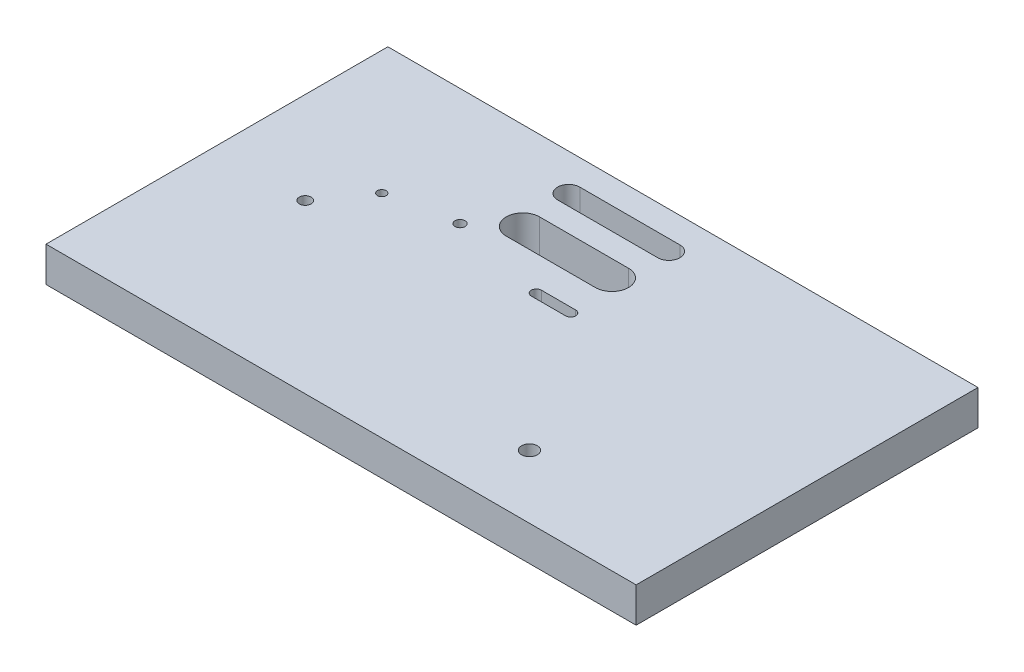
ISO-10303-21;
HEADER;
FILE_DESCRIPTION(('STEP AP214'),'2;1');
FILE_NAME('part.step','',(''),(''),'','','');
FILE_SCHEMA(('AUTOMOTIVE_DESIGN { 1 0 10303 214 1 1 1 1 }'));
ENDSEC;
DATA;
#1=APPLICATION_CONTEXT('core data for automotive mechanical design processes');
#2=APPLICATION_PROTOCOL_DEFINITION('international standard','automotive_design',2000,#1);
#3=PRODUCT_CONTEXT('',#1,'mechanical');
#4=PRODUCT('Part','Part','',(#3));
#5=PRODUCT_RELATED_PRODUCT_CATEGORY('part','',(#4));
#6=PRODUCT_DEFINITION_FORMATION('','',#4);
#7=PRODUCT_DEFINITION_CONTEXT('part definition',#1,'design');
#8=PRODUCT_DEFINITION('design','',#6,#7);
#9=PRODUCT_DEFINITION_SHAPE('','',#8);
#10=(LENGTH_UNIT() NAMED_UNIT(*) SI_UNIT(.MILLI.,.METRE.));
#11=(NAMED_UNIT(*) PLANE_ANGLE_UNIT() SI_UNIT($,.RADIAN.));
#12=(NAMED_UNIT(*) SI_UNIT($,.STERADIAN.) SOLID_ANGLE_UNIT());
#13=UNCERTAINTY_MEASURE_WITH_UNIT(LENGTH_MEASURE(1.E-05),#10,'distance_accuracy_value','');
#14=(GEOMETRIC_REPRESENTATION_CONTEXT(3) GLOBAL_UNCERTAINTY_ASSIGNED_CONTEXT((#13)) GLOBAL_UNIT_ASSIGNED_CONTEXT((#10,
#11,#12)) REPRESENTATION_CONTEXT('',''));
#15=CARTESIAN_POINT('',(0.,0.,0.));
#16=DIRECTION('',(0.,0.,1.));
#17=DIRECTION('',(1.,0.,0.));
#18=AXIS2_PLACEMENT_3D('',#15,#16,#17);
#19=CARTESIAN_POINT('',(0.,5.,0.));
#20=DIRECTION('',(0.,1.,0.));
#21=DIRECTION('',(0.,0.,1.));
#22=AXIS2_PLACEMENT_3D('',#19,#20,#21);
#23=PLANE('',#22);
#24=DIRECTION('',(0.,0.,-1.));
#25=VECTOR('',#24,1.);
#26=CARTESIAN_POINT('',(84.3608093431512,5.,0.));
#27=LINE('',#26,#25);
#28=CARTESIAN_POINT('',(84.3608093431512,5.,0.));
#29=VERTEX_POINT('',#28);
#30=CARTESIAN_POINT('',(84.3608093431512,5.,-97.739616111228));
#31=VERTEX_POINT('',#30);
#32=EDGE_CURVE('E493',#29,#31,#27,.T.);
#33=ORIENTED_EDGE('',*,*,#32,.T.);
#34=DIRECTION('',(-1.,0.,0.));
#35=VECTOR('',#34,1.);
#36=CARTESIAN_POINT('',(84.3608093431512,5.,-97.739616111228));
#37=LINE('',#36,#35);
#38=CARTESIAN_POINT('',(-84.3608093431512,5.,-97.739616111228));
#39=VERTEX_POINT('',#38);
#40=EDGE_CURVE('E496',#31,#39,#37,.T.);
#41=ORIENTED_EDGE('',*,*,#40,.T.);
#42=DIRECTION('',(0.,0.,1.));
#43=VECTOR('',#42,1.);
#44=CARTESIAN_POINT('',(-84.3608093431512,5.,0.));
#45=LINE('',#44,#43);
#46=CARTESIAN_POINT('',(-84.3608093431512,5.,0.));
#47=VERTEX_POINT('',#46);
#48=EDGE_CURVE('E499',#39,#47,#45,.T.);
#49=ORIENTED_EDGE('',*,*,#48,.T.);
#50=DIRECTION('',(1.,0.,0.));
#51=VECTOR('',#50,1.);
#52=CARTESIAN_POINT('',(84.3608093431512,5.,0.));
#53=LINE('',#52,#51);
#54=EDGE_CURVE('E501',#47,#29,#53,.T.);
#55=ORIENTED_EDGE('',*,*,#54,.T.);
#56=EDGE_LOOP('',(#33,#41,#49,#55));
#57=FACE_BOUND('',#56,.T.);
#58=CARTESIAN_POINT('',(-58.1138542371732,5.,-47.8549594350749));
#59=DIRECTION('',(0.,1.,0.));
#60=DIRECTION('',(0.,0.,1.));
#61=AXIS2_PLACEMENT_3D('',#58,#59,#60);
#62=CIRCLE('',#61,1.7);
#63=CARTESIAN_POINT('',(-58.1138542371732,5.,-46.1549594350749));
#64=VERTEX_POINT('',#63);
#65=EDGE_CURVE('E486',#64,#64,#62,.T.);
#66=ORIENTED_EDGE('',*,*,#65,.F.);
#67=EDGE_LOOP('',(#66));
#68=FACE_BOUND('',#67,.T.);
#69=CARTESIAN_POINT('',(-48.9861644972557,5.,-60.622514535719));
#70=DIRECTION('',(0.,1.,0.));
#71=DIRECTION('',(0.,0.,1.));
#72=AXIS2_PLACEMENT_3D('',#69,#70,#71);
#73=CIRCLE('',#72,1.25);
#74=CARTESIAN_POINT('',(-48.9861644972557,5.,-59.372514535719));
#75=VERTEX_POINT('',#74);
#76=EDGE_CURVE('E480',#75,#75,#73,.T.);
#77=ORIENTED_EDGE('',*,*,#76,.F.);
#78=EDGE_LOOP('',(#77));
#79=FACE_BOUND('',#78,.T.);
#80=CARTESIAN_POINT('',(-30.247448848378,5.,-64.270030424007));
#81=DIRECTION('',(0.,1.,0.));
#82=DIRECTION('',(0.,0.,1.));
#83=AXIS2_PLACEMENT_3D('',#80,#81,#82);
#84=CIRCLE('',#83,1.45);
#85=CARTESIAN_POINT('',(-30.247448848378,5.,-62.8200304240071));
#86=VERTEX_POINT('',#85);
#87=EDGE_CURVE('E474',#86,#86,#84,.T.);
#88=ORIENTED_EDGE('',*,*,#87,.F.);
#89=EDGE_LOOP('',(#88));
#90=FACE_BOUND('',#89,.T.);
#91=CARTESIAN_POINT('',(35.7902377850241,5.,-18.0705278971374));
#92=DIRECTION('',(0.,1.,0.));
#93=DIRECTION('',(0.,0.,1.));
#94=AXIS2_PLACEMENT_3D('',#91,#92,#93);
#95=CIRCLE('',#94,2.25);
#96=CARTESIAN_POINT('',(35.7902377850241,5.,-15.8205278971374));
#97=VERTEX_POINT('',#96);
#98=EDGE_CURVE('E468',#97,#97,#95,.T.);
#99=ORIENTED_EDGE('',*,*,#98,.F.);
#100=EDGE_LOOP('',(#99));
#101=FACE_BOUND('',#100,.T.);
#102=CARTESIAN_POINT('',(-2.13594485593026,5.,-57.9697826681667));
#103=DIRECTION('',(0.,1.,0.));
#104=DIRECTION('',(0.,0.,1.));
#105=AXIS2_PLACEMENT_3D('',#102,#103,#104);
#106=CIRCLE('',#105,1.45);
#107=CARTESIAN_POINT('',(-2.13594485593026,5.,-59.4197826681667));
#108=VERTEX_POINT('',#107);
#109=CARTESIAN_POINT('',(-2.13594485593026,5.,-56.5197826681667));
#110=VERTEX_POINT('',#109);
#111=EDGE_CURVE('E447',#108,#110,#106,.T.);
#112=ORIENTED_EDGE('',*,*,#111,.F.);
#113=DIRECTION('',(1.,0.,0.));
#114=VECTOR('',#113,1.);
#115=CARTESIAN_POINT('',(-2.13594485593026,5.,-59.4197826681667));
#116=LINE('',#115,#114);
#117=CARTESIAN_POINT('',(7.66405514406974,5.,-59.4197826681667));
#118=VERTEX_POINT('',#117);
#119=EDGE_CURVE('E444',#108,#118,#116,.T.);
#120=ORIENTED_EDGE('',*,*,#119,.T.);
#121=CARTESIAN_POINT('',(7.66405514406974,5.,-57.9697826681667));
#122=DIRECTION('',(0.,1.,0.));
#123=DIRECTION('',(0.,0.,1.));
#124=AXIS2_PLACEMENT_3D('',#121,#122,#123);
#125=CIRCLE('',#124,1.45);
#126=CARTESIAN_POINT('',(7.66405514406974,5.,-56.5197826681667));
#127=VERTEX_POINT('',#126);
#128=EDGE_CURVE('E457',#127,#118,#125,.T.);
#129=ORIENTED_EDGE('',*,*,#128,.F.);
#130=DIRECTION('',(1.,0.,0.));
#131=VECTOR('',#130,1.);
#132=CARTESIAN_POINT('',(-2.13594485593026,5.,-56.5197826681666));
#133=LINE('',#132,#131);
#134=EDGE_CURVE('E436',#110,#127,#133,.T.);
#135=ORIENTED_EDGE('',*,*,#134,.F.);
#136=EDGE_LOOP('',(#112,#120,#129,#135));
#137=FACE_BOUND('',#136,.T.);
#138=DIRECTION('',(1.,0.,0.));
#139=VECTOR('',#138,1.);
#140=CARTESIAN_POINT('',(-20.5727153209111,5.,-77.3083922894191));
#141=LINE('',#140,#139);
#142=CARTESIAN_POINT('',(-20.5727153209111,5.,-77.3083922894191));
#143=VERTEX_POINT('',#142);
#144=CARTESIAN_POINT('',(4.90229087908889,5.,-77.3083922894191));
#145=VERTEX_POINT('',#144);
#146=EDGE_CURVE('E413',#143,#145,#141,.T.);
#147=ORIENTED_EDGE('',*,*,#146,.T.);
#148=CARTESIAN_POINT('',(4.90229087908889,5.,-72.5458922894191));
#149=DIRECTION('',(0.,1.,0.));
#150=DIRECTION('',(0.,0.,1.));
#151=AXIS2_PLACEMENT_3D('',#148,#149,#150);
#152=CIRCLE('',#151,4.7625);
#153=CARTESIAN_POINT('',(4.90229087908889,5.,-67.7833922894191));
#154=VERTEX_POINT('',#153);
#155=EDGE_CURVE('E426',#154,#145,#152,.T.);
#156=ORIENTED_EDGE('',*,*,#155,.F.);
#157=DIRECTION('',(1.,0.,0.));
#158=VECTOR('',#157,1.);
#159=CARTESIAN_POINT('',(-20.5727153209111,5.,-67.7833922894191));
#160=LINE('',#159,#158);
#161=CARTESIAN_POINT('',(-20.5727153209111,5.,-67.7833922894191));
#162=VERTEX_POINT('',#161);
#163=EDGE_CURVE('E406',#162,#154,#160,.T.);
#164=ORIENTED_EDGE('',*,*,#163,.F.);
#165=CARTESIAN_POINT('',(-20.5727153209111,5.,-72.5458922894191));
#166=DIRECTION('',(0.,1.,0.));
#167=DIRECTION('',(0.,0.,1.));
#168=AXIS2_PLACEMENT_3D('',#165,#166,#167);
#169=CIRCLE('',#168,4.7625);
#170=EDGE_CURVE('E416',#143,#162,#169,.T.);
#171=ORIENTED_EDGE('',*,*,#170,.F.);
#172=EDGE_LOOP('',(#147,#156,#164,#171));
#173=FACE_BOUND('',#172,.T.);
#174=CARTESIAN_POINT('',(-22.1870017630031,5.,-87.2550365653098));
#175=DIRECTION('',(0.,1.,0.));
#176=DIRECTION('',(0.,0.,1.));
#177=AXIS2_PLACEMENT_3D('',#174,#175,#176);
#178=CIRCLE('',#177,3.175);
#179=CARTESIAN_POINT('',(-22.1870017630031,5.,-90.4300365653097));
#180=VERTEX_POINT('',#179);
#181=CARTESIAN_POINT('',(-22.1870017630031,5.,-84.0800365653098));
#182=VERTEX_POINT('',#181);
#183=EDGE_CURVE('E273',#180,#182,#178,.T.);
#184=ORIENTED_EDGE('',*,*,#183,.F.);
#185=DIRECTION('',(1.,0.,0.));
#186=VECTOR('',#185,1.);
#187=CARTESIAN_POINT('',(-22.1870017630031,5.,-90.4300365653097));
#188=LINE('',#187,#186);
#189=CARTESIAN_POINT('',(6.46300443699692,5.,-90.4300365653097));
#190=VERTEX_POINT('',#189);
#191=EDGE_CURVE('E375',#180,#190,#188,.T.);
#192=ORIENTED_EDGE('',*,*,#191,.T.);
#193=CARTESIAN_POINT('',(6.46300443699692,5.,-87.2550365653098));
#194=DIRECTION('',(0.,1.,0.));
#195=DIRECTION('',(0.,0.,1.));
#196=AXIS2_PLACEMENT_3D('',#193,#194,#195);
#197=CIRCLE('',#196,3.175);
#198=CARTESIAN_POINT('',(6.46300443699692,5.,-84.0800365653097));
#199=VERTEX_POINT('',#198);
#200=EDGE_CURVE('E390',#199,#190,#197,.T.);
#201=ORIENTED_EDGE('',*,*,#200,.F.);
#202=DIRECTION('',(1.,0.,0.));
#203=VECTOR('',#202,1.);
#204=CARTESIAN_POINT('',(-22.1870017630031,5.,-84.0800365653097));
#205=LINE('',#204,#203);
#206=EDGE_CURVE('E394',#182,#199,#205,.T.);
#207=ORIENTED_EDGE('',*,*,#206,.F.);
#208=EDGE_LOOP('',(#184,#192,#201,#207));
#209=FACE_BOUND('',#208,.T.);
#210=ADVANCED_FACE('F258',(#57,#68,#79,#90,#101,#137,#173,#209),#23,.T.);
#211=CARTESIAN_POINT('',(84.3608093431512,5.,0.));
#212=DIRECTION('',(-1.,0.,0.));
#213=DIRECTION('',(0.,0.,1.));
#214=AXIS2_PLACEMENT_3D('',#211,#212,#213);
#215=PLANE('',#214);
#216=DIRECTION('',(0.,0.,-1.));
#217=VECTOR('',#216,1.);
#218=CARTESIAN_POINT('',(84.3608093431512,-5.,0.));
#219=LINE('',#218,#217);
#220=CARTESIAN_POINT('',(84.3608093431512,-5.,0.));
#221=VERTEX_POINT('',#220);
#222=CARTESIAN_POINT('',(84.3608093431512,-5.,-97.739616111228));
#223=VERTEX_POINT('',#222);
#224=EDGE_CURVE('E492',#221,#223,#219,.T.);
#225=ORIENTED_EDGE('',*,*,#224,.T.);
#226=DIRECTION('',(0.,-1.,0.));
#227=VECTOR('',#226,1.);
#228=CARTESIAN_POINT('',(84.3608093431512,5.,-97.739616111228));
#229=LINE('',#228,#227);
#230=EDGE_CURVE('E13',#31,#223,#229,.T.);
#231=ORIENTED_EDGE('',*,*,#230,.F.);
#232=ORIENTED_EDGE('',*,*,#32,.F.);
#233=DIRECTION('',(0.,-1.,0.));
#234=VECTOR('',#233,1.);
#235=CARTESIAN_POINT('',(84.3608093431512,5.,0.));
#236=LINE('',#235,#234);
#237=EDGE_CURVE('E503',#29,#221,#236,.T.);
#238=ORIENTED_EDGE('',*,*,#237,.T.);
#239=EDGE_LOOP('',(#225,#231,#232,#238));
#240=FACE_BOUND('',#239,.T.);
#241=ADVANCED_FACE('F260',(#240),#215,.F.);
#242=CARTESIAN_POINT('',(84.3608093431512,5.,-97.739616111228));
#243=DIRECTION('',(0.,0.,1.));
#244=DIRECTION('',(1.,0.,0.));
#245=AXIS2_PLACEMENT_3D('',#242,#243,#244);
#246=PLANE('',#245);
#247=DIRECTION('',(-1.,0.,0.));
#248=VECTOR('',#247,1.);
#249=CARTESIAN_POINT('',(84.3608093431512,-5.,-97.739616111228));
#250=LINE('',#249,#248);
#251=CARTESIAN_POINT('',(-84.3608093431512,-5.,-97.739616111228));
#252=VERTEX_POINT('',#251);
#253=EDGE_CURVE('E506',#223,#252,#250,.T.);
#254=ORIENTED_EDGE('',*,*,#253,.T.);
#255=DIRECTION('',(0.,-1.,0.));
#256=VECTOR('',#255,1.);
#257=CARTESIAN_POINT('',(-84.3608093431512,5.,-97.739616111228));
#258=LINE('',#257,#256);
#259=EDGE_CURVE('E266',#39,#252,#258,.T.);
#260=ORIENTED_EDGE('',*,*,#259,.F.);
#261=ORIENTED_EDGE('',*,*,#40,.F.);
#262=ORIENTED_EDGE('',*,*,#230,.T.);
#263=EDGE_LOOP('',(#254,#260,#261,#262));
#264=FACE_BOUND('',#263,.T.);
#265=ADVANCED_FACE('F536',(#264),#246,.F.);
#266=CARTESIAN_POINT('',(-84.3608093431512,5.,0.));
#267=DIRECTION('',(1.,0.,0.));
#268=DIRECTION('',(0.,0.,-1.));
#269=AXIS2_PLACEMENT_3D('',#266,#267,#268);
#270=PLANE('',#269);
#271=DIRECTION('',(0.,0.,1.));
#272=VECTOR('',#271,1.);
#273=CARTESIAN_POINT('',(-84.3608093431512,-5.,0.));
#274=LINE('',#273,#272);
#275=CARTESIAN_POINT('',(-84.3608093431512,-5.,0.));
#276=VERTEX_POINT('',#275);
#277=EDGE_CURVE('E508',#252,#276,#274,.T.);
#278=ORIENTED_EDGE('',*,*,#277,.T.);
#279=DIRECTION('',(0.,-1.,0.));
#280=VECTOR('',#279,1.);
#281=CARTESIAN_POINT('',(-84.3608093431512,5.,0.));
#282=LINE('',#281,#280);
#283=EDGE_CURVE('E513',#47,#276,#282,.T.);
#284=ORIENTED_EDGE('',*,*,#283,.F.);
#285=ORIENTED_EDGE('',*,*,#48,.F.);
#286=ORIENTED_EDGE('',*,*,#259,.T.);
#287=EDGE_LOOP('',(#278,#284,#285,#286));
#288=FACE_BOUND('',#287,.T.);
#289=ADVANCED_FACE('F520',(#288),#270,.F.);
#290=CARTESIAN_POINT('',(84.3608093431512,5.,0.));
#291=DIRECTION('',(0.,0.,-1.));
#292=DIRECTION('',(-1.,0.,0.));
#293=AXIS2_PLACEMENT_3D('',#290,#291,#292);
#294=PLANE('',#293);
#295=DIRECTION('',(1.,0.,0.));
#296=VECTOR('',#295,1.);
#297=CARTESIAN_POINT('',(84.3608093431512,-5.,0.));
#298=LINE('',#297,#296);
#299=EDGE_CURVE('E497',#276,#221,#298,.T.);
#300=ORIENTED_EDGE('',*,*,#299,.T.);
#301=ORIENTED_EDGE('',*,*,#237,.F.);
#302=ORIENTED_EDGE('',*,*,#54,.F.);
#303=ORIENTED_EDGE('',*,*,#283,.T.);
#304=EDGE_LOOP('',(#300,#301,#302,#303));
#305=FACE_BOUND('',#304,.T.);
#306=ADVANCED_FACE('F529',(#305),#294,.F.);
#307=CARTESIAN_POINT('',(0.,-5.,0.));
#308=DIRECTION('',(0.,1.,0.));
#309=DIRECTION('',(0.,0.,1.));
#310=AXIS2_PLACEMENT_3D('',#307,#308,#309);
#311=PLANE('',#310);
#312=DIRECTION('',(1.,0.,0.));
#313=VECTOR('',#312,1.);
#314=CARTESIAN_POINT('',(-22.1870017630031,-5.,-84.0800365653098));
#315=LINE('',#314,#313);
#316=CARTESIAN_POINT('',(-22.1870017630031,-5.,-84.0800365653098));
#317=VERTEX_POINT('',#316);
#318=CARTESIAN_POINT('',(6.46300443699692,-5.,-84.0800365653098));
#319=VERTEX_POINT('',#318);
#320=EDGE_CURVE('E708',#317,#319,#315,.T.);
#321=ORIENTED_EDGE('',*,*,#320,.T.);
#322=CARTESIAN_POINT('',(6.46300443699692,-5.,-87.2550365653098));
#323=DIRECTION('',(0.,1.,0.));
#324=DIRECTION('',(0.,0.,1.));
#325=AXIS2_PLACEMENT_3D('',#322,#323,#324);
#326=CIRCLE('',#325,3.175);
#327=CARTESIAN_POINT('',(6.46300443699692,-5.,-90.4300365653097));
#328=VERTEX_POINT('',#327);
#329=EDGE_CURVE('E401',#319,#328,#326,.T.);
#330=ORIENTED_EDGE('',*,*,#329,.T.);
#331=DIRECTION('',(1.,0.,0.));
#332=VECTOR('',#331,1.);
#333=CARTESIAN_POINT('',(-22.1870017630031,-5.,-90.4300365653097));
#334=LINE('',#333,#332);
#335=CARTESIAN_POINT('',(-22.1870017630031,-5.,-90.4300365653097));
#336=VERTEX_POINT('',#335);
#337=EDGE_CURVE('E384',#336,#328,#334,.T.);
#338=ORIENTED_EDGE('',*,*,#337,.F.);
#339=CARTESIAN_POINT('',(-22.1870017630031,-5.,-87.2550365653098));
#340=DIRECTION('',(0.,1.,0.));
#341=DIRECTION('',(0.,0.,1.));
#342=AXIS2_PLACEMENT_3D('',#339,#340,#341);
#343=CIRCLE('',#342,3.175);
#344=EDGE_CURVE('E388',#336,#317,#343,.T.);
#345=ORIENTED_EDGE('',*,*,#344,.T.);
#346=EDGE_LOOP('',(#321,#330,#338,#345));
#347=FACE_BOUND('',#346,.T.);
#348=CARTESIAN_POINT('',(4.90229087908889,-5.,-72.5458922894191));
#349=DIRECTION('',(0.,1.,0.));
#350=DIRECTION('',(0.,0.,1.));
#351=AXIS2_PLACEMENT_3D('',#348,#349,#350);
#352=CIRCLE('',#351,4.7625);
#353=CARTESIAN_POINT('',(4.90229087908889,-5.,-67.7833922894191));
#354=VERTEX_POINT('',#353);
#355=CARTESIAN_POINT('',(4.90229087908889,-5.,-77.3083922894191));
#356=VERTEX_POINT('',#355);
#357=EDGE_CURVE('E429',#354,#356,#352,.T.);
#358=ORIENTED_EDGE('',*,*,#357,.T.);
#359=DIRECTION('',(1.,0.,0.));
#360=VECTOR('',#359,1.);
#361=CARTESIAN_POINT('',(-20.5727153209111,-5.,-77.3083922894191));
#362=LINE('',#361,#360);
#363=CARTESIAN_POINT('',(-20.5727153209111,-5.,-77.3083922894191));
#364=VERTEX_POINT('',#363);
#365=EDGE_CURVE('E411',#364,#356,#362,.T.);
#366=ORIENTED_EDGE('',*,*,#365,.F.);
#367=CARTESIAN_POINT('',(-20.5727153209111,-5.,-72.5458922894191));
#368=DIRECTION('',(0.,1.,0.));
#369=DIRECTION('',(0.,0.,1.));
#370=AXIS2_PLACEMENT_3D('',#367,#368,#369);
#371=CIRCLE('',#370,4.7625);
#372=CARTESIAN_POINT('',(-20.5727153209111,-4.99999999999999,-67.7833922894191));
#373=VERTEX_POINT('',#372);
#374=EDGE_CURVE('E418',#364,#373,#371,.T.);
#375=ORIENTED_EDGE('',*,*,#374,.T.);
#376=DIRECTION('',(1.,0.,0.));
#377=VECTOR('',#376,1.);
#378=CARTESIAN_POINT('',(-20.5727153209111,-4.99999999999999,-67.7833922894191));
#379=LINE('',#378,#377);
#380=EDGE_CURVE('E408',#373,#354,#379,.T.);
#381=ORIENTED_EDGE('',*,*,#380,.T.);
#382=EDGE_LOOP('',(#358,#366,#375,#381));
#383=FACE_BOUND('',#382,.T.);
#384=CARTESIAN_POINT('',(7.66405514406974,-5.,-57.9697826681667));
#385=DIRECTION('',(0.,1.,0.));
#386=DIRECTION('',(0.,0.,1.));
#387=AXIS2_PLACEMENT_3D('',#384,#385,#386);
#388=CIRCLE('',#387,1.45);
#389=CARTESIAN_POINT('',(7.66405514406974,-5.,-56.5197826681667));
#390=VERTEX_POINT('',#389);
#391=CARTESIAN_POINT('',(7.66405514406974,-5.,-59.4197826681667));
#392=VERTEX_POINT('',#391);
#393=EDGE_CURVE('E460',#390,#392,#388,.T.);
#394=ORIENTED_EDGE('',*,*,#393,.T.);
#395=DIRECTION('',(1.,0.,0.));
#396=VECTOR('',#395,1.);
#397=CARTESIAN_POINT('',(-2.13594485593026,-5.,-59.4197826681667));
#398=LINE('',#397,#396);
#399=CARTESIAN_POINT('',(-2.13594485593026,-5.,-59.4197826681667));
#400=VERTEX_POINT('',#399);
#401=EDGE_CURVE('E442',#400,#392,#398,.T.);
#402=ORIENTED_EDGE('',*,*,#401,.F.);
#403=CARTESIAN_POINT('',(-2.13594485593026,-5.,-57.9697826681667));
#404=DIRECTION('',(0.,1.,0.));
#405=DIRECTION('',(0.,0.,1.));
#406=AXIS2_PLACEMENT_3D('',#403,#404,#405);
#407=CIRCLE('',#406,1.45);
#408=CARTESIAN_POINT('',(-2.13594485593026,-5.,-56.5197826681667));
#409=VERTEX_POINT('',#408);
#410=EDGE_CURVE('E450',#400,#409,#407,.T.);
#411=ORIENTED_EDGE('',*,*,#410,.T.);
#412=DIRECTION('',(1.,0.,0.));
#413=VECTOR('',#412,1.);
#414=CARTESIAN_POINT('',(-2.13594485593026,-5.,-56.5197826681667));
#415=LINE('',#414,#413);
#416=EDGE_CURVE('E439',#409,#390,#415,.T.);
#417=ORIENTED_EDGE('',*,*,#416,.T.);
#418=EDGE_LOOP('',(#394,#402,#411,#417));
#419=FACE_BOUND('',#418,.T.);
#420=CARTESIAN_POINT('',(-30.247448848378,-5.,-64.270030424007));
#421=DIRECTION('',(0.,1.,0.));
#422=DIRECTION('',(0.,0.,1.));
#423=AXIS2_PLACEMENT_3D('',#420,#421,#422);
#424=CIRCLE('',#423,1.45);
#425=CARTESIAN_POINT('',(-30.247448848378,-5.,-62.8200304240071));
#426=VERTEX_POINT('',#425);
#427=EDGE_CURVE('E477',#426,#426,#424,.T.);
#428=ORIENTED_EDGE('',*,*,#427,.T.);
#429=EDGE_LOOP('',(#428));
#430=FACE_BOUND('',#429,.T.);
#431=CARTESIAN_POINT('',(-48.9861644972557,-5.,-60.622514535719));
#432=DIRECTION('',(0.,1.,0.));
#433=DIRECTION('',(0.,0.,1.));
#434=AXIS2_PLACEMENT_3D('',#431,#432,#433);
#435=CIRCLE('',#434,1.24999999999999);
#436=CARTESIAN_POINT('',(-48.9861644972557,-5.,-59.372514535719));
#437=VERTEX_POINT('',#436);
#438=EDGE_CURVE('E483',#437,#437,#435,.T.);
#439=ORIENTED_EDGE('',*,*,#438,.T.);
#440=EDGE_LOOP('',(#439));
#441=FACE_BOUND('',#440,.T.);
#442=CARTESIAN_POINT('',(-58.1138542371732,-5.,-47.8549594350749));
#443=DIRECTION('',(0.,1.,0.));
#444=DIRECTION('',(0.,0.,1.));
#445=AXIS2_PLACEMENT_3D('',#442,#443,#444);
#446=CIRCLE('',#445,1.7);
#447=CARTESIAN_POINT('',(-58.1138542371732,-5.,-46.1549594350749));
#448=VERTEX_POINT('',#447);
#449=EDGE_CURVE('E489',#448,#448,#446,.T.);
#450=ORIENTED_EDGE('',*,*,#449,.T.);
#451=EDGE_LOOP('',(#450));
#452=FACE_BOUND('',#451,.T.);
#453=ORIENTED_EDGE('',*,*,#224,.F.);
#454=ORIENTED_EDGE('',*,*,#299,.F.);
#455=ORIENTED_EDGE('',*,*,#277,.F.);
#456=ORIENTED_EDGE('',*,*,#253,.F.);
#457=EDGE_LOOP('',(#453,#454,#455,#456));
#458=FACE_BOUND('',#457,.T.);
#459=ADVANCED_FACE('F526',(#347,#383,#419,#430,#441,#452,#458),#311,.F.);
#460=CARTESIAN_POINT('',(-58.1138542371732,5.,-47.8549594350749));
#461=DIRECTION('',(0.,1.,0.));
#462=DIRECTION('',(0.,0.,1.));
#463=AXIS2_PLACEMENT_3D('',#460,#461,#462);
#464=CYLINDRICAL_SURFACE('',#463,1.7);
#465=ORIENTED_EDGE('',*,*,#449,.F.);
#466=EDGE_LOOP('',(#465));
#467=FACE_BOUND('',#466,.T.);
#468=ORIENTED_EDGE('',*,*,#65,.T.);
#469=EDGE_LOOP('',(#468));
#470=FACE_BOUND('',#469,.T.);
#471=ADVANCED_FACE('F551',(#467,#470),#464,.F.);
#472=CARTESIAN_POINT('',(-48.9861644972557,5.,-60.622514535719));
#473=DIRECTION('',(0.,1.,0.));
#474=DIRECTION('',(0.,0.,1.));
#475=AXIS2_PLACEMENT_3D('',#472,#473,#474);
#476=CYLINDRICAL_SURFACE('',#475,1.25);
#477=ORIENTED_EDGE('',*,*,#438,.F.);
#478=EDGE_LOOP('',(#477));
#479=FACE_BOUND('',#478,.T.);
#480=ORIENTED_EDGE('',*,*,#76,.T.);
#481=EDGE_LOOP('',(#480));
#482=FACE_BOUND('',#481,.T.);
#483=ADVANCED_FACE('F574',(#479,#482),#476,.F.);
#484=CARTESIAN_POINT('',(-30.247448848378,5.,-64.270030424007));
#485=DIRECTION('',(0.,1.,0.));
#486=DIRECTION('',(0.,0.,1.));
#487=AXIS2_PLACEMENT_3D('',#484,#485,#486);
#488=CYLINDRICAL_SURFACE('',#487,1.45);
#489=ORIENTED_EDGE('',*,*,#427,.F.);
#490=EDGE_LOOP('',(#489));
#491=FACE_BOUND('',#490,.T.);
#492=ORIENTED_EDGE('',*,*,#87,.T.);
#493=EDGE_LOOP('',(#492));
#494=FACE_BOUND('',#493,.T.);
#495=ADVANCED_FACE('F580',(#491,#494),#488,.F.);
#496=CARTESIAN_POINT('',(35.7902377850241,1.,-18.0705278971374));
#497=DIRECTION('',(0.,1.,0.));
#498=DIRECTION('',(0.,0.,1.));
#499=AXIS2_PLACEMENT_3D('',#496,#497,#498);
#500=CONICAL_SURFACE('',#499,2.25,1.02974425867665);
#501=CARTESIAN_POINT('',(35.7902377850241,-0.351936392812011,-18.0705278971374));
#502=VERTEX_POINT('',#501);
#503=VERTEX_LOOP('',#502);
#504=FACE_BOUND('',#503,.T.);
#505=CARTESIAN_POINT('',(35.7902377850241,1.,-18.0705278971374));
#506=DIRECTION('',(0.,1.,0.));
#507=DIRECTION('',(0.,0.,1.));
#508=AXIS2_PLACEMENT_3D('',#505,#506,#507);
#509=CIRCLE('',#508,2.25);
#510=CARTESIAN_POINT('',(35.7902377850241,1.,-15.8205278971374));
#511=VERTEX_POINT('',#510);
#512=EDGE_CURVE('E471',#511,#511,#509,.T.);
#513=ORIENTED_EDGE('',*,*,#512,.T.);
#514=EDGE_LOOP('',(#513));
#515=FACE_BOUND('',#514,.T.);
#516=ADVANCED_FACE('F587',(#504,#515),#500,.F.);
#517=CARTESIAN_POINT('',(35.7902377850241,5.,-18.0705278971374));
#518=DIRECTION('',(0.,1.,0.));
#519=DIRECTION('',(0.,0.,1.));
#520=AXIS2_PLACEMENT_3D('',#517,#518,#519);
#521=CYLINDRICAL_SURFACE('',#520,2.25);
#522=ORIENTED_EDGE('',*,*,#512,.F.);
#523=EDGE_LOOP('',(#522));
#524=FACE_BOUND('',#523,.T.);
#525=ORIENTED_EDGE('',*,*,#98,.T.);
#526=EDGE_LOOP('',(#525));
#527=FACE_BOUND('',#526,.T.);
#528=ADVANCED_FACE('F595',(#524,#527),#521,.F.);
#529=CARTESIAN_POINT('',(7.66405514406974,5.,-57.9697826681667));
#530=DIRECTION('',(0.,1.,0.));
#531=DIRECTION('',(0.,0.,1.));
#532=AXIS2_PLACEMENT_3D('',#529,#530,#531);
#533=CYLINDRICAL_SURFACE('',#532,1.45);
#534=ORIENTED_EDGE('',*,*,#393,.F.);
#535=DIRECTION('',(0.,1.,0.));
#536=VECTOR('',#535,1.);
#537=CARTESIAN_POINT('',(7.66405514406974,5.,-56.5197826681667));
#538=LINE('',#537,#536);
#539=EDGE_CURVE('E465',#127,#390,#538,.F.);
#540=ORIENTED_EDGE('',*,*,#539,.F.);
#541=ORIENTED_EDGE('',*,*,#128,.T.);
#542=DIRECTION('',(0.,1.,0.));
#543=VECTOR('',#542,1.);
#544=CARTESIAN_POINT('',(7.66405514406974,5.,-59.4197826681667));
#545=LINE('',#544,#543);
#546=EDGE_CURVE('E463',#392,#118,#545,.T.);
#547=ORIENTED_EDGE('',*,*,#546,.F.);
#548=EDGE_LOOP('',(#534,#540,#541,#547));
#549=FACE_BOUND('',#548,.T.);
#550=ADVANCED_FACE('F603',(#549),#533,.F.);
#551=CARTESIAN_POINT('',(-2.13594485593026,5.,-57.9697826681667));
#552=DIRECTION('',(0.,1.,0.));
#553=DIRECTION('',(0.,0.,1.));
#554=AXIS2_PLACEMENT_3D('',#551,#552,#553);
#555=CYLINDRICAL_SURFACE('',#554,1.45);
#556=ORIENTED_EDGE('',*,*,#111,.T.);
#557=DIRECTION('',(0.,1.,0.));
#558=VECTOR('',#557,1.);
#559=CARTESIAN_POINT('',(-2.13594485593026,5.,-56.5197826681667));
#560=LINE('',#559,#558);
#561=EDGE_CURVE('E453',#409,#110,#560,.T.);
#562=ORIENTED_EDGE('',*,*,#561,.F.);
#563=ORIENTED_EDGE('',*,*,#410,.F.);
#564=DIRECTION('',(0.,1.,0.));
#565=VECTOR('',#564,1.);
#566=CARTESIAN_POINT('',(-2.13594485593026,5.,-59.4197826681667));
#567=LINE('',#566,#565);
#568=EDGE_CURVE('E455',#108,#400,#567,.F.);
#569=ORIENTED_EDGE('',*,*,#568,.F.);
#570=EDGE_LOOP('',(#556,#562,#563,#569));
#571=FACE_BOUND('',#570,.T.);
#572=ADVANCED_FACE('F611',(#571),#555,.F.);
#573=CARTESIAN_POINT('',(-2.13594485593026,5.,-59.4197826681667));
#574=DIRECTION('',(0.,0.,-1.));
#575=DIRECTION('',(-1.,0.,0.));
#576=AXIS2_PLACEMENT_3D('',#573,#574,#575);
#577=PLANE('',#576);
#578=ORIENTED_EDGE('',*,*,#546,.T.);
#579=ORIENTED_EDGE('',*,*,#119,.F.);
#580=ORIENTED_EDGE('',*,*,#568,.T.);
#581=ORIENTED_EDGE('',*,*,#401,.T.);
#582=EDGE_LOOP('',(#578,#579,#580,#581));
#583=FACE_BOUND('',#582,.T.);
#584=ADVANCED_FACE('F619',(#583),#577,.F.);
#585=CARTESIAN_POINT('',(-2.13594485593026,5.,-56.5197826681667));
#586=DIRECTION('',(0.,0.,1.));
#587=DIRECTION('',(1.,0.,0.));
#588=AXIS2_PLACEMENT_3D('',#585,#586,#587);
#589=PLANE('',#588);
#590=ORIENTED_EDGE('',*,*,#539,.T.);
#591=ORIENTED_EDGE('',*,*,#416,.F.);
#592=ORIENTED_EDGE('',*,*,#561,.T.);
#593=ORIENTED_EDGE('',*,*,#134,.T.);
#594=EDGE_LOOP('',(#590,#591,#592,#593));
#595=FACE_BOUND('',#594,.T.);
#596=ADVANCED_FACE('F627',(#595),#589,.F.);
#597=CARTESIAN_POINT('',(4.90229087908889,5.,-72.5458922894191));
#598=DIRECTION('',(0.,1.,0.));
#599=DIRECTION('',(0.,0.,1.));
#600=AXIS2_PLACEMENT_3D('',#597,#598,#599);
#601=CYLINDRICAL_SURFACE('',#600,4.7625);
#602=ORIENTED_EDGE('',*,*,#357,.F.);
#603=DIRECTION('',(0.,1.,0.));
#604=VECTOR('',#603,1.);
#605=CARTESIAN_POINT('',(4.90229087908889,5.,-67.7833922894191));
#606=LINE('',#605,#604);
#607=EDGE_CURVE('E434',#154,#354,#606,.F.);
#608=ORIENTED_EDGE('',*,*,#607,.F.);
#609=ORIENTED_EDGE('',*,*,#155,.T.);
#610=DIRECTION('',(0.,1.,0.));
#611=VECTOR('',#610,1.);
#612=CARTESIAN_POINT('',(4.90229087908889,5.,-77.3083922894191));
#613=LINE('',#612,#611);
#614=EDGE_CURVE('E432',#356,#145,#613,.T.);
#615=ORIENTED_EDGE('',*,*,#614,.F.);
#616=EDGE_LOOP('',(#602,#608,#609,#615));
#617=FACE_BOUND('',#616,.T.);
#618=ADVANCED_FACE('F635',(#617),#601,.F.);
#619=CARTESIAN_POINT('',(-20.5727153209111,5.,-72.5458922894191));
#620=DIRECTION('',(0.,1.,0.));
#621=DIRECTION('',(0.,0.,1.));
#622=AXIS2_PLACEMENT_3D('',#619,#620,#621);
#623=CYLINDRICAL_SURFACE('',#622,4.7625);
#624=ORIENTED_EDGE('',*,*,#170,.T.);
#625=DIRECTION('',(0.,1.,0.));
#626=VECTOR('',#625,1.);
#627=CARTESIAN_POINT('',(-20.5727153209111,5.,-67.7833922894191));
#628=LINE('',#627,#626);
#629=EDGE_CURVE('E421',#373,#162,#628,.T.);
#630=ORIENTED_EDGE('',*,*,#629,.F.);
#631=ORIENTED_EDGE('',*,*,#374,.F.);
#632=DIRECTION('',(0.,1.,0.));
#633=VECTOR('',#632,1.);
#634=CARTESIAN_POINT('',(-20.5727153209111,5.,-77.3083922894191));
#635=LINE('',#634,#633);
#636=EDGE_CURVE('E424',#143,#364,#635,.F.);
#637=ORIENTED_EDGE('',*,*,#636,.F.);
#638=EDGE_LOOP('',(#624,#630,#631,#637));
#639=FACE_BOUND('',#638,.T.);
#640=ADVANCED_FACE('F649',(#639),#623,.F.);
#641=CARTESIAN_POINT('',(-20.5727153209111,5.,-77.3083922894191));
#642=DIRECTION('',(0.,0.,-1.));
#643=DIRECTION('',(-1.,0.,0.));
#644=AXIS2_PLACEMENT_3D('',#641,#642,#643);
#645=PLANE('',#644);
#646=ORIENTED_EDGE('',*,*,#614,.T.);
#647=ORIENTED_EDGE('',*,*,#146,.F.);
#648=ORIENTED_EDGE('',*,*,#636,.T.);
#649=ORIENTED_EDGE('',*,*,#365,.T.);
#650=EDGE_LOOP('',(#646,#647,#648,#649));
#651=FACE_BOUND('',#650,.T.);
#652=ADVANCED_FACE('F657',(#651),#645,.F.);
#653=CARTESIAN_POINT('',(-20.5727153209111,5.,-67.7833922894191));
#654=DIRECTION('',(0.,0.,1.));
#655=DIRECTION('',(1.,0.,0.));
#656=AXIS2_PLACEMENT_3D('',#653,#654,#655);
#657=PLANE('',#656);
#658=ORIENTED_EDGE('',*,*,#607,.T.);
#659=ORIENTED_EDGE('',*,*,#380,.F.);
#660=ORIENTED_EDGE('',*,*,#629,.T.);
#661=ORIENTED_EDGE('',*,*,#163,.T.);
#662=EDGE_LOOP('',(#658,#659,#660,#661));
#663=FACE_BOUND('',#662,.T.);
#664=ADVANCED_FACE('F665',(#663),#657,.F.);
#665=CARTESIAN_POINT('',(6.46300443699692,5.,-87.2550365653098));
#666=DIRECTION('',(0.,1.,0.));
#667=DIRECTION('',(0.,0.,1.));
#668=AXIS2_PLACEMENT_3D('',#665,#666,#667);
#669=CYLINDRICAL_SURFACE('',#668,3.175);
#670=ORIENTED_EDGE('',*,*,#329,.F.);
#671=DIRECTION('',(0.,1.,0.));
#672=VECTOR('',#671,1.);
#673=CARTESIAN_POINT('',(6.46300443699692,5.,-84.0800365653098));
#674=LINE('',#673,#672);
#675=EDGE_CURVE('E281',#199,#319,#674,.F.);
#676=ORIENTED_EDGE('',*,*,#675,.F.);
#677=ORIENTED_EDGE('',*,*,#200,.T.);
#678=DIRECTION('',(0.,1.,0.));
#679=VECTOR('',#678,1.);
#680=CARTESIAN_POINT('',(6.46300443699692,5.,-90.4300365653097));
#681=LINE('',#680,#679);
#682=EDGE_CURVE('E380',#328,#190,#681,.T.);
#683=ORIENTED_EDGE('',*,*,#682,.F.);
#684=EDGE_LOOP('',(#670,#676,#677,#683));
#685=FACE_BOUND('',#684,.T.);
#686=ADVANCED_FACE('F672',(#685),#669,.F.);
#687=CARTESIAN_POINT('',(-22.1870017630031,5.,-87.2550365653098));
#688=DIRECTION('',(0.,1.,0.));
#689=DIRECTION('',(0.,0.,1.));
#690=AXIS2_PLACEMENT_3D('',#687,#688,#689);
#691=CYLINDRICAL_SURFACE('',#690,3.175);
#692=ORIENTED_EDGE('',*,*,#183,.T.);
#693=DIRECTION('',(0.,1.,0.));
#694=VECTOR('',#693,1.);
#695=CARTESIAN_POINT('',(-22.1870017630031,5.,-84.0800365653098));
#696=LINE('',#695,#694);
#697=EDGE_CURVE('E391',#317,#182,#696,.T.);
#698=ORIENTED_EDGE('',*,*,#697,.F.);
#699=ORIENTED_EDGE('',*,*,#344,.F.);
#700=DIRECTION('',(0.,1.,0.));
#701=VECTOR('',#700,1.);
#702=CARTESIAN_POINT('',(-22.1870017630031,5.,-90.4300365653097));
#703=LINE('',#702,#701);
#704=EDGE_CURVE('E377',#180,#336,#703,.F.);
#705=ORIENTED_EDGE('',*,*,#704,.F.);
#706=EDGE_LOOP('',(#692,#698,#699,#705));
#707=FACE_BOUND('',#706,.T.);
#708=ADVANCED_FACE('F386',(#707),#691,.F.);
#709=CARTESIAN_POINT('',(-22.1870017630031,5.,-90.4300365653097));
#710=DIRECTION('',(0.,0.,-1.));
#711=DIRECTION('',(-1.,0.,0.));
#712=AXIS2_PLACEMENT_3D('',#709,#710,#711);
#713=PLANE('',#712);
#714=ORIENTED_EDGE('',*,*,#682,.T.);
#715=ORIENTED_EDGE('',*,*,#191,.F.);
#716=ORIENTED_EDGE('',*,*,#704,.T.);
#717=ORIENTED_EDGE('',*,*,#337,.T.);
#718=EDGE_LOOP('',(#714,#715,#716,#717));
#719=FACE_BOUND('',#718,.T.);
#720=ADVANCED_FACE('F376',(#719),#713,.F.);
#721=CARTESIAN_POINT('',(-22.1870017630031,5.,-84.0800365653098));
#722=DIRECTION('',(0.,0.,1.));
#723=DIRECTION('',(1.,0.,0.));
#724=AXIS2_PLACEMENT_3D('',#721,#722,#723);
#725=PLANE('',#724);
#726=ORIENTED_EDGE('',*,*,#675,.T.);
#727=ORIENTED_EDGE('',*,*,#320,.F.);
#728=ORIENTED_EDGE('',*,*,#697,.T.);
#729=ORIENTED_EDGE('',*,*,#206,.T.);
#730=EDGE_LOOP('',(#726,#727,#728,#729));
#731=FACE_BOUND('',#730,.T.);
#732=ADVANCED_FACE('F690',(#731),#725,.F.);
#733=CLOSED_SHELL('',(#210,#241,#265,#289,#306,#459,#471,#483,#495,#516,#528,#550,#572,#584,
#596,#618,#640,#652,#664,#686,#708,#720,#732));
#734=MANIFOLD_SOLID_BREP('B2',#733);
#735=ADVANCED_BREP_SHAPE_REPRESENTATION('',(#18,#734),#14);
#736=SHAPE_DEFINITION_REPRESENTATION(#9,#735);
ENDSEC;
END-ISO-10303-21;
